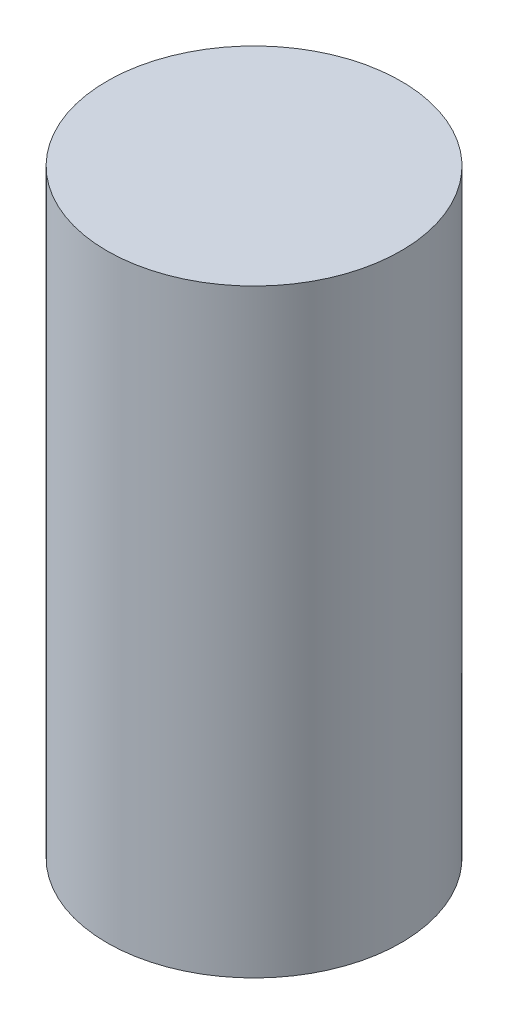
ISO-10303-21;
HEADER;
FILE_DESCRIPTION(('STEP AP214'),'2;1');
FILE_NAME('part.step','',(''),(''),'','','');
FILE_SCHEMA(('AUTOMOTIVE_DESIGN { 1 0 10303 214 1 1 1 1 }'));
ENDSEC;
DATA;
#1=APPLICATION_CONTEXT('core data for automotive mechanical design processes');
#2=APPLICATION_PROTOCOL_DEFINITION('international standard','automotive_design',2000,#1);
#3=PRODUCT_CONTEXT('',#1,'mechanical');
#4=PRODUCT('Part','Part','',(#3));
#5=PRODUCT_RELATED_PRODUCT_CATEGORY('part','',(#4));
#6=PRODUCT_DEFINITION_FORMATION('','',#4);
#7=PRODUCT_DEFINITION_CONTEXT('part definition',#1,'design');
#8=PRODUCT_DEFINITION('design','',#6,#7);
#9=PRODUCT_DEFINITION_SHAPE('','',#8);
#10=(LENGTH_UNIT() NAMED_UNIT(*) SI_UNIT(.MILLI.,.METRE.));
#11=(NAMED_UNIT(*) PLANE_ANGLE_UNIT() SI_UNIT($,.RADIAN.));
#12=(NAMED_UNIT(*) SI_UNIT($,.STERADIAN.) SOLID_ANGLE_UNIT());
#13=UNCERTAINTY_MEASURE_WITH_UNIT(LENGTH_MEASURE(1.E-05),#10,'distance_accuracy_value','');
#14=(GEOMETRIC_REPRESENTATION_CONTEXT(3) GLOBAL_UNCERTAINTY_ASSIGNED_CONTEXT((#13)) GLOBAL_UNIT_ASSIGNED_CONTEXT((#10,
#11,#12)) REPRESENTATION_CONTEXT('',''));
#15=CARTESIAN_POINT('',(0.,0.,0.));
#16=DIRECTION('',(0.,0.,1.));
#17=DIRECTION('',(1.,0.,0.));
#18=AXIS2_PLACEMENT_3D('',#15,#16,#17);
#19=CARTESIAN_POINT('',(0.,31.5,0.));
#20=DIRECTION('',(0.,-1.,0.));
#21=DIRECTION('',(0.,0.,-1.));
#22=AXIS2_PLACEMENT_3D('',#19,#20,#21);
#23=CYLINDRICAL_SURFACE('',#22,7.73);
#24=CARTESIAN_POINT('',(0.,31.5,0.));
#25=DIRECTION('',(0.,1.,0.));
#26=DIRECTION('',(0.,0.,1.));
#27=AXIS2_PLACEMENT_3D('',#24,#25,#26);
#28=CIRCLE('',#27,7.73);
#29=CARTESIAN_POINT('',(0.,31.5,7.73));
#30=VERTEX_POINT('',#29);
#31=EDGE_CURVE('E10',#30,#30,#28,.T.);
#32=ORIENTED_EDGE('',*,*,#31,.F.);
#33=EDGE_LOOP('',(#32));
#34=FACE_BOUND('',#33,.T.);
#35=CARTESIAN_POINT('',(0.,0.,0.));
#36=DIRECTION('',(0.,1.,0.));
#37=DIRECTION('',(0.,0.,1.));
#38=AXIS2_PLACEMENT_3D('',#35,#36,#37);
#39=CIRCLE('',#38,7.73);
#40=CARTESIAN_POINT('',(0.,0.,7.73));
#41=VERTEX_POINT('',#40);
#42=EDGE_CURVE('E33',#41,#41,#39,.T.);
#43=ORIENTED_EDGE('',*,*,#42,.T.);
#44=EDGE_LOOP('',(#43));
#45=FACE_BOUND('',#44,.T.);
#46=ADVANCED_FACE('F30',(#34,#45),#23,.T.);
#47=CARTESIAN_POINT('',(0.,31.5,0.));
#48=DIRECTION('',(0.,1.,0.));
#49=DIRECTION('',(0.,0.,1.));
#50=AXIS2_PLACEMENT_3D('',#47,#48,#49);
#51=PLANE('',#50);
#52=ORIENTED_EDGE('',*,*,#31,.T.);
#53=EDGE_LOOP('',(#52));
#54=FACE_BOUND('',#53,.T.);
#55=ADVANCED_FACE('F45',(#54),#51,.T.);
#56=CARTESIAN_POINT('',(0.,0.,0.));
#57=DIRECTION('',(0.,1.,0.));
#58=DIRECTION('',(0.,0.,1.));
#59=AXIS2_PLACEMENT_3D('',#56,#57,#58);
#60=PLANE('',#59);
#61=ORIENTED_EDGE('',*,*,#42,.F.);
#62=EDGE_LOOP('',(#61));
#63=FACE_BOUND('',#62,.T.);
#64=ADVANCED_FACE('F43',(#63),#60,.F.);
#65=CLOSED_SHELL('',(#46,#55,#64));
#66=MANIFOLD_SOLID_BREP('B2',#65);
#67=ADVANCED_BREP_SHAPE_REPRESENTATION('',(#18,#66),#14);
#68=SHAPE_DEFINITION_REPRESENTATION(#9,#67);
ENDSEC;
END-ISO-10303-21;
